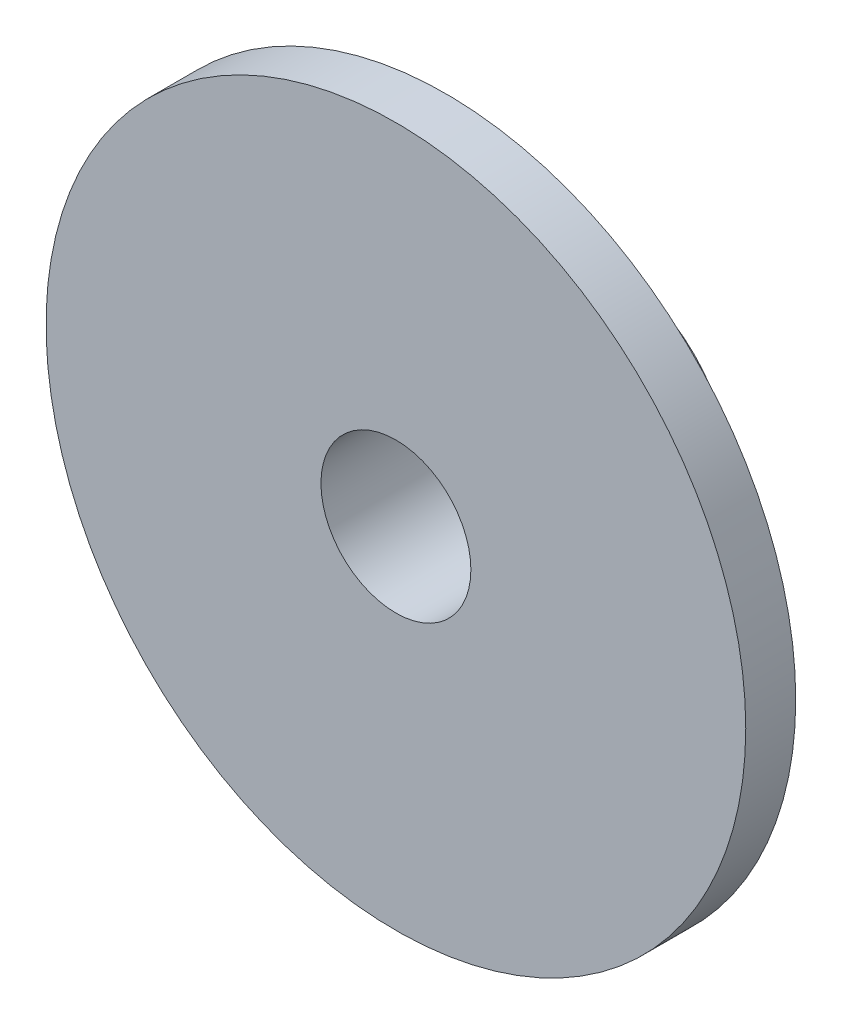
ISO-10303-21;
HEADER;
FILE_DESCRIPTION(('STEP AP214'),'2;1');
FILE_NAME('part.step','',(''),(''),'','','');
FILE_SCHEMA(('AUTOMOTIVE_DESIGN { 1 0 10303 214 1 1 1 1 }'));
ENDSEC;
DATA;
#1=APPLICATION_CONTEXT('core data for automotive mechanical design processes');
#2=APPLICATION_PROTOCOL_DEFINITION('international standard','automotive_design',2000,#1);
#3=PRODUCT_CONTEXT('',#1,'mechanical');
#4=PRODUCT('Part','Part','',(#3));
#5=PRODUCT_RELATED_PRODUCT_CATEGORY('part','',(#4));
#6=PRODUCT_DEFINITION_FORMATION('','',#4);
#7=PRODUCT_DEFINITION_CONTEXT('part definition',#1,'design');
#8=PRODUCT_DEFINITION('design','',#6,#7);
#9=PRODUCT_DEFINITION_SHAPE('','',#8);
#10=(LENGTH_UNIT() NAMED_UNIT(*) SI_UNIT(.MILLI.,.METRE.));
#11=(NAMED_UNIT(*) PLANE_ANGLE_UNIT() SI_UNIT($,.RADIAN.));
#12=(NAMED_UNIT(*) SI_UNIT($,.STERADIAN.) SOLID_ANGLE_UNIT());
#13=UNCERTAINTY_MEASURE_WITH_UNIT(LENGTH_MEASURE(1.E-05),#10,'distance_accuracy_value','');
#14=(GEOMETRIC_REPRESENTATION_CONTEXT(3) GLOBAL_UNCERTAINTY_ASSIGNED_CONTEXT((#13)) GLOBAL_UNIT_ASSIGNED_CONTEXT((#10,
#11,#12)) REPRESENTATION_CONTEXT('',''));
#15=CARTESIAN_POINT('',(0.,0.,0.));
#16=DIRECTION('',(0.,0.,1.));
#17=DIRECTION('',(1.,0.,0.));
#18=AXIS2_PLACEMENT_3D('',#15,#16,#17);
#19=CARTESIAN_POINT('',(0.,0.,0.));
#20=DIRECTION('',(0.,0.,1.));
#21=DIRECTION('',(1.,0.,0.));
#22=AXIS2_PLACEMENT_3D('',#19,#20,#21);
#23=PLANE('',#22);
#24=CARTESIAN_POINT('',(0.,0.,0.));
#25=DIRECTION('',(0.,0.,1.));
#26=DIRECTION('',(1.,0.,0.));
#27=AXIS2_PLACEMENT_3D('',#24,#25,#26);
#28=CIRCLE('',#27,22.225);
#29=CARTESIAN_POINT('',(22.225,0.,0.));
#30=VERTEX_POINT('',#29);
#31=EDGE_CURVE('E50',#30,#30,#28,.T.);
#32=ORIENTED_EDGE('',*,*,#31,.F.);
#33=EDGE_LOOP('',(#32));
#34=FACE_BOUND('',#33,.T.);
#35=CARTESIAN_POINT('',(0.,0.,0.));
#36=DIRECTION('',(0.,0.,1.));
#37=DIRECTION('',(1.,0.,0.));
#38=AXIS2_PLACEMENT_3D('',#35,#36,#37);
#39=CIRCLE('',#38,7.9375);
#40=CARTESIAN_POINT('',(7.9375,0.,0.));
#41=VERTEX_POINT('',#40);
#42=EDGE_CURVE('E10',#41,#41,#39,.F.);
#43=ORIENTED_EDGE('',*,*,#42,.F.);
#44=EDGE_LOOP('',(#43));
#45=FACE_BOUND('',#44,.T.);
#46=ADVANCED_FACE('F37',(#34,#45),#23,.F.);
#47=CARTESIAN_POINT('',(0.,0.,3.175));
#48=DIRECTION('',(0.,0.,1.));
#49=DIRECTION('',(1.,0.,0.));
#50=AXIS2_PLACEMENT_3D('',#47,#48,#49);
#51=PLANE('',#50);
#52=CARTESIAN_POINT('',(0.,0.,3.175));
#53=DIRECTION('',(0.,0.,1.));
#54=DIRECTION('',(1.,0.,0.));
#55=AXIS2_PLACEMENT_3D('',#52,#53,#54);
#56=CIRCLE('',#55,22.225);
#57=CARTESIAN_POINT('',(22.225,0.,3.175));
#58=VERTEX_POINT('',#57);
#59=EDGE_CURVE('E45',#58,#58,#56,.T.);
#60=ORIENTED_EDGE('',*,*,#59,.T.);
#61=EDGE_LOOP('',(#60));
#62=FACE_BOUND('',#61,.T.);
#63=CARTESIAN_POINT('',(0.,0.,3.175));
#64=DIRECTION('',(0.,0.,1.));
#65=DIRECTION('',(1.,0.,0.));
#66=AXIS2_PLACEMENT_3D('',#63,#64,#65);
#67=CIRCLE('',#66,4.7625);
#68=CARTESIAN_POINT('',(4.7625,0.,3.175));
#69=VERTEX_POINT('',#68);
#70=EDGE_CURVE('E56',#69,#69,#67,.T.);
#71=ORIENTED_EDGE('',*,*,#70,.F.);
#72=EDGE_LOOP('',(#71));
#73=FACE_BOUND('',#72,.T.);
#74=ADVANCED_FACE('F86',(#62,#73),#51,.T.);
#75=CARTESIAN_POINT('',(0.,0.,3.175));
#76=DIRECTION('',(0.,0.,-1.));
#77=DIRECTION('',(-1.,0.,0.));
#78=AXIS2_PLACEMENT_3D('',#75,#76,#77);
#79=CYLINDRICAL_SURFACE('',#78,22.225);
#80=ORIENTED_EDGE('',*,*,#59,.F.);
#81=EDGE_LOOP('',(#80));
#82=FACE_BOUND('',#81,.T.);
#83=ORIENTED_EDGE('',*,*,#31,.T.);
#84=EDGE_LOOP('',(#83));
#85=FACE_BOUND('',#84,.T.);
#86=ADVANCED_FACE('F39',(#82,#85),#79,.T.);
#87=CARTESIAN_POINT('',(0.,0.,3.175));
#88=DIRECTION('',(0.,0.,-1.));
#89=DIRECTION('',(-1.,0.,0.));
#90=AXIS2_PLACEMENT_3D('',#87,#88,#89);
#91=CYLINDRICAL_SURFACE('',#90,4.7625);
#92=ORIENTED_EDGE('',*,*,#70,.T.);
#93=EDGE_LOOP('',(#92));
#94=FACE_BOUND('',#93,.T.);
#95=CARTESIAN_POINT('',(0.,0.,-10.16));
#96=DIRECTION('',(0.,0.,-1.));
#97=DIRECTION('',(-1.,0.,0.));
#98=AXIS2_PLACEMENT_3D('',#95,#96,#97);
#99=CIRCLE('',#98,4.7625);
#100=CARTESIAN_POINT('',(-4.7625,0.,-10.16));
#101=VERTEX_POINT('',#100);
#102=EDGE_CURVE('E65',#101,#101,#99,.T.);
#103=ORIENTED_EDGE('',*,*,#102,.T.);
#104=EDGE_LOOP('',(#103));
#105=FACE_BOUND('',#104,.T.);
#106=ADVANCED_FACE('F70',(#94,#105),#91,.F.);
#107=CARTESIAN_POINT('',(0.,0.,-10.16));
#108=DIRECTION('',(0.,0.,-1.));
#109=DIRECTION('',(-1.,0.,0.));
#110=AXIS2_PLACEMENT_3D('',#107,#108,#109);
#111=PLANE('',#110);
#112=CARTESIAN_POINT('',(0.,0.,-10.16));
#113=DIRECTION('',(0.,0.,-1.));
#114=DIRECTION('',(-1.,0.,0.));
#115=AXIS2_PLACEMENT_3D('',#112,#113,#114);
#116=CIRCLE('',#115,7.9375);
#117=CARTESIAN_POINT('',(-7.9375,0.,-10.16));
#118=VERTEX_POINT('',#117);
#119=EDGE_CURVE('E61',#118,#118,#116,.T.);
#120=ORIENTED_EDGE('',*,*,#119,.T.);
#121=EDGE_LOOP('',(#120));
#122=FACE_BOUND('',#121,.T.);
#123=ORIENTED_EDGE('',*,*,#102,.F.);
#124=EDGE_LOOP('',(#123));
#125=FACE_BOUND('',#124,.T.);
#126=ADVANCED_FACE('F72',(#122,#125),#111,.T.);
#127=CARTESIAN_POINT('',(0.,0.,-10.16));
#128=DIRECTION('',(0.,0.,1.));
#129=DIRECTION('',(1.,0.,0.));
#130=AXIS2_PLACEMENT_3D('',#127,#128,#129);
#131=CYLINDRICAL_SURFACE('',#130,7.9375);
#132=ORIENTED_EDGE('',*,*,#119,.F.);
#133=EDGE_LOOP('',(#132));
#134=FACE_BOUND('',#133,.T.);
#135=ORIENTED_EDGE('',*,*,#42,.T.);
#136=EDGE_LOOP('',(#135));
#137=FACE_BOUND('',#136,.T.);
#138=ADVANCED_FACE('F74',(#134,#137),#131,.T.);
#139=CLOSED_SHELL('',(#46,#74,#86,#106,#126,#138));
#140=MANIFOLD_SOLID_BREP('B2',#139);
#141=ADVANCED_BREP_SHAPE_REPRESENTATION('',(#18,#140),#14);
#142=SHAPE_DEFINITION_REPRESENTATION(#9,#141);
ENDSEC;
END-ISO-10303-21;
